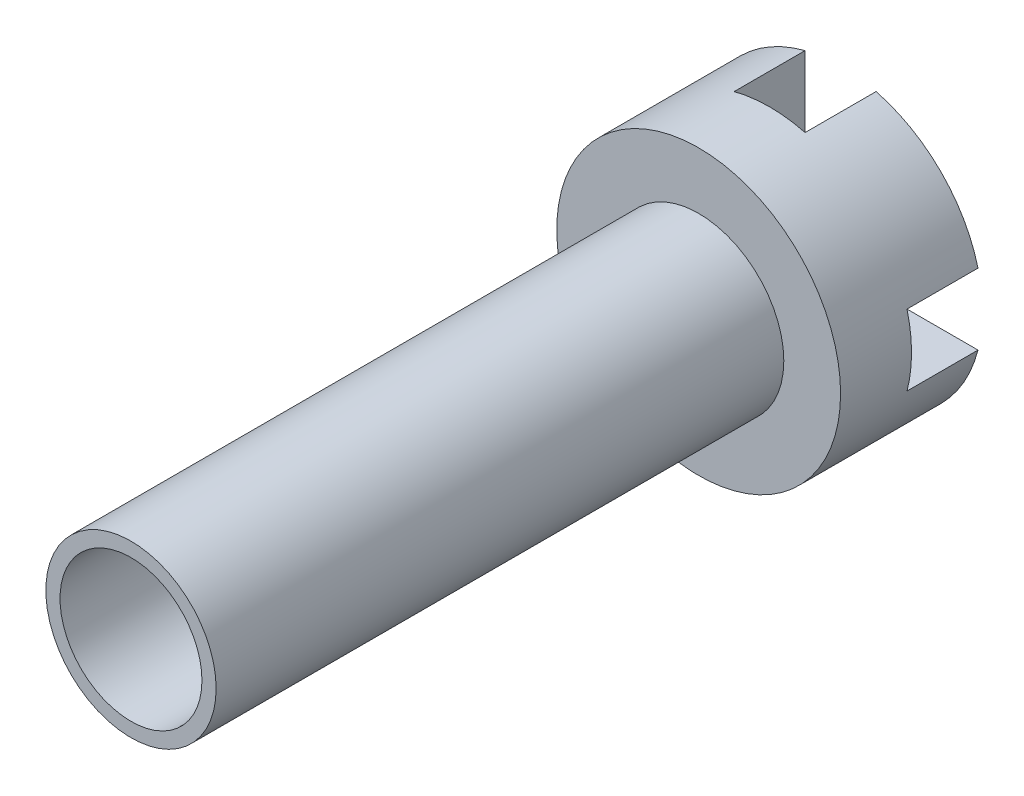
ISO-10303-21;
HEADER;
FILE_DESCRIPTION(('STEP AP214'),'2;1');
FILE_NAME('part.step','',(''),(''),'','','');
FILE_SCHEMA(('AUTOMOTIVE_DESIGN { 1 0 10303 214 1 1 1 1 }'));
ENDSEC;
DATA;
#1=APPLICATION_CONTEXT('core data for automotive mechanical design processes');
#2=APPLICATION_PROTOCOL_DEFINITION('international standard','automotive_design',2000,#1);
#3=PRODUCT_CONTEXT('',#1,'mechanical');
#4=PRODUCT('Part','Part','',(#3));
#5=PRODUCT_RELATED_PRODUCT_CATEGORY('part','',(#4));
#6=PRODUCT_DEFINITION_FORMATION('','',#4);
#7=PRODUCT_DEFINITION_CONTEXT('part definition',#1,'design');
#8=PRODUCT_DEFINITION('design','',#6,#7);
#9=PRODUCT_DEFINITION_SHAPE('','',#8);
#10=(LENGTH_UNIT() NAMED_UNIT(*) SI_UNIT(.MILLI.,.METRE.));
#11=(NAMED_UNIT(*) PLANE_ANGLE_UNIT() SI_UNIT($,.RADIAN.));
#12=(NAMED_UNIT(*) SI_UNIT($,.STERADIAN.) SOLID_ANGLE_UNIT());
#13=UNCERTAINTY_MEASURE_WITH_UNIT(LENGTH_MEASURE(1.E-05),#10,'distance_accuracy_value','');
#14=(GEOMETRIC_REPRESENTATION_CONTEXT(3) GLOBAL_UNCERTAINTY_ASSIGNED_CONTEXT((#13)) GLOBAL_UNIT_ASSIGNED_CONTEXT((#10,
#11,#12)) REPRESENTATION_CONTEXT('',''));
#15=CARTESIAN_POINT('',(0.,0.,0.));
#16=DIRECTION('',(0.,0.,1.));
#17=DIRECTION('',(1.,0.,0.));
#18=AXIS2_PLACEMENT_3D('',#15,#16,#17);
#19=CARTESIAN_POINT('',(0.,0.,10.));
#20=DIRECTION('',(0.,0.,-1.));
#21=DIRECTION('',(-1.,0.,0.));
#22=AXIS2_PLACEMENT_3D('',#19,#20,#21);
#23=CYLINDRICAL_SURFACE('',#22,10.);
#24=CARTESIAN_POINT('',(0.,0.,10.));
#25=DIRECTION('',(0.,0.,1.));
#26=DIRECTION('',(1.,0.,0.));
#27=AXIS2_PLACEMENT_3D('',#24,#25,#26);
#28=CIRCLE('',#27,10.);
#29=CARTESIAN_POINT('',(10.,0.,10.));
#30=VERTEX_POINT('',#29);
#31=EDGE_CURVE('E41',#30,#30,#28,.T.);
#32=ORIENTED_EDGE('',*,*,#31,.F.);
#33=EDGE_LOOP('',(#32));
#34=FACE_BOUND('',#33,.T.);
#35=DIRECTION('',(0.,0.,-1.));
#36=VECTOR('',#35,1.);
#37=CARTESIAN_POINT('',(-2.5,9.68245836551854,5.));
#38=LINE('',#37,#36);
#39=CARTESIAN_POINT('',(-2.5,9.68245836551854,5.));
#40=VERTEX_POINT('',#39);
#41=CARTESIAN_POINT('',(-2.5,9.68245836551854,0.));
#42=VERTEX_POINT('',#41);
#43=EDGE_CURVE('E106',#40,#42,#38,.T.);
#44=ORIENTED_EDGE('',*,*,#43,.T.);
#45=CARTESIAN_POINT('',(0.,0.,0.));
#46=DIRECTION('',(0.,0.,1.));
#47=DIRECTION('',(1.,0.,0.));
#48=AXIS2_PLACEMENT_3D('',#45,#46,#47);
#49=CIRCLE('',#48,10.);
#50=CARTESIAN_POINT('',(-9.68245836551854,2.5,0.));
#51=VERTEX_POINT('',#50);
#52=EDGE_CURVE('E210',#42,#51,#49,.T.);
#53=ORIENTED_EDGE('',*,*,#52,.T.);
#54=DIRECTION('',(0.,0.,-1.));
#55=VECTOR('',#54,1.);
#56=CARTESIAN_POINT('',(-9.68245836551854,2.5,5.));
#57=LINE('',#56,#55);
#58=CARTESIAN_POINT('',(-9.68245836551854,2.5,5.));
#59=VERTEX_POINT('',#58);
#60=EDGE_CURVE('E143',#59,#51,#57,.T.);
#61=ORIENTED_EDGE('',*,*,#60,.F.);
#62=CARTESIAN_POINT('',(0.,0.,5.));
#63=DIRECTION('',(0.,0.,-1.));
#64=DIRECTION('',(-1.,0.,0.));
#65=AXIS2_PLACEMENT_3D('',#62,#63,#64);
#66=CIRCLE('',#65,10.);
#67=CARTESIAN_POINT('',(-9.68245836551854,-2.5,5.));
#68=VERTEX_POINT('',#67);
#69=EDGE_CURVE('E148',#68,#59,#66,.T.);
#70=ORIENTED_EDGE('',*,*,#69,.F.);
#71=DIRECTION('',(0.,0.,-1.));
#72=VECTOR('',#71,1.);
#73=CARTESIAN_POINT('',(-9.68245836551854,-2.5,5.));
#74=LINE('',#73,#72);
#75=CARTESIAN_POINT('',(-9.68245836551854,-2.5,0.));
#76=VERTEX_POINT('',#75);
#77=EDGE_CURVE('E133',#68,#76,#74,.T.);
#78=ORIENTED_EDGE('',*,*,#77,.T.);
#79=CARTESIAN_POINT('',(-2.5,-9.68245836551854,0.));
#80=VERTEX_POINT('',#79);
#81=EDGE_CURVE('E212',#76,#80,#49,.T.);
#82=ORIENTED_EDGE('',*,*,#81,.T.);
#83=DIRECTION('',(0.,0.,-1.));
#84=VECTOR('',#83,1.);
#85=CARTESIAN_POINT('',(-2.5,-9.68245836551854,5.));
#86=LINE('',#85,#84);
#87=CARTESIAN_POINT('',(-2.5,-9.68245836551854,5.));
#88=VERTEX_POINT('',#87);
#89=EDGE_CURVE('E182',#88,#80,#86,.T.);
#90=ORIENTED_EDGE('',*,*,#89,.F.);
#91=CARTESIAN_POINT('',(0.,0.,5.));
#92=DIRECTION('',(0.,0.,-1.));
#93=DIRECTION('',(-1.,0.,0.));
#94=AXIS2_PLACEMENT_3D('',#91,#92,#93);
#95=CIRCLE('',#94,10.);
#96=CARTESIAN_POINT('',(2.5,-9.68245836551854,5.));
#97=VERTEX_POINT('',#96);
#98=EDGE_CURVE('E223',#97,#88,#95,.T.);
#99=ORIENTED_EDGE('',*,*,#98,.F.);
#100=DIRECTION('',(0.,0.,-1.));
#101=VECTOR('',#100,1.);
#102=CARTESIAN_POINT('',(2.5,-9.68245836551854,5.));
#103=LINE('',#102,#101);
#104=CARTESIAN_POINT('',(2.5,-9.68245836551854,0.));
#105=VERTEX_POINT('',#104);
#106=EDGE_CURVE('E184',#97,#105,#103,.T.);
#107=ORIENTED_EDGE('',*,*,#106,.T.);
#108=CARTESIAN_POINT('',(9.68245836551854,-2.5,0.));
#109=VERTEX_POINT('',#108);
#110=EDGE_CURVE('E205',#105,#109,#49,.T.);
#111=ORIENTED_EDGE('',*,*,#110,.T.);
#112=DIRECTION('',(0.,0.,-1.));
#113=VECTOR('',#112,1.);
#114=CARTESIAN_POINT('',(9.68245836551854,-2.5,5.));
#115=LINE('',#114,#113);
#116=CARTESIAN_POINT('',(9.68245836551854,-2.5,5.));
#117=VERTEX_POINT('',#116);
#118=EDGE_CURVE('E189',#117,#109,#115,.T.);
#119=ORIENTED_EDGE('',*,*,#118,.F.);
#120=CARTESIAN_POINT('',(0.,0.,5.));
#121=DIRECTION('',(0.,0.,-1.));
#122=DIRECTION('',(-1.,0.,0.));
#123=AXIS2_PLACEMENT_3D('',#120,#121,#122);
#124=CIRCLE('',#123,10.);
#125=CARTESIAN_POINT('',(9.68245836551854,2.5,5.));
#126=VERTEX_POINT('',#125);
#127=EDGE_CURVE('E233',#126,#117,#124,.T.);
#128=ORIENTED_EDGE('',*,*,#127,.F.);
#129=DIRECTION('',(0.,0.,-1.));
#130=VECTOR('',#129,1.);
#131=CARTESIAN_POINT('',(9.68245836551854,2.5,5.));
#132=LINE('',#131,#130);
#133=CARTESIAN_POINT('',(9.68245836551854,2.5,0.));
#134=VERTEX_POINT('',#133);
#135=EDGE_CURVE('E191',#126,#134,#132,.T.);
#136=ORIENTED_EDGE('',*,*,#135,.T.);
#137=CARTESIAN_POINT('',(2.5,9.68245836551854,0.));
#138=VERTEX_POINT('',#137);
#139=EDGE_CURVE('E36',#134,#138,#49,.T.);
#140=ORIENTED_EDGE('',*,*,#139,.T.);
#141=DIRECTION('',(0.,0.,-1.));
#142=VECTOR('',#141,1.);
#143=CARTESIAN_POINT('',(2.5,9.68245836551854,5.));
#144=LINE('',#143,#142);
#145=CARTESIAN_POINT('',(2.5,9.68245836551854,5.));
#146=VERTEX_POINT('',#145);
#147=EDGE_CURVE('E49',#146,#138,#144,.T.);
#148=ORIENTED_EDGE('',*,*,#147,.F.);
#149=CARTESIAN_POINT('',(0.,0.,5.));
#150=DIRECTION('',(0.,0.,-1.));
#151=DIRECTION('',(-1.,0.,0.));
#152=AXIS2_PLACEMENT_3D('',#149,#150,#151);
#153=CIRCLE('',#152,10.);
#154=EDGE_CURVE('E241',#40,#146,#153,.T.);
#155=ORIENTED_EDGE('',*,*,#154,.F.);
#156=EDGE_LOOP('',(#44,#53,#61,#70,#78,#82,#90,#99,#107,#111,#119,#128,#136,#140,#148,#155));
#157=FACE_BOUND('',#156,.T.);
#158=ADVANCED_FACE('F33',(#34,#157),#23,.T.);
#159=CARTESIAN_POINT('',(0.,0.,0.));
#160=DIRECTION('',(0.,0.,1.));
#161=DIRECTION('',(1.,0.,0.));
#162=AXIS2_PLACEMENT_3D('',#159,#160,#161);
#163=PLANE('',#162);
#164=DIRECTION('',(0.,-1.,0.));
#165=VECTOR('',#164,1.);
#166=CARTESIAN_POINT('',(-2.5,0.,0.));
#167=LINE('',#166,#165);
#168=CARTESIAN_POINT('',(-2.5,2.5,0.));
#169=VERTEX_POINT('',#168);
#170=EDGE_CURVE('E158',#42,#169,#167,.T.);
#171=ORIENTED_EDGE('',*,*,#170,.T.);
#172=DIRECTION('',(-1.,0.,0.));
#173=VECTOR('',#172,1.);
#174=CARTESIAN_POINT('',(0.,2.5,0.));
#175=LINE('',#174,#173);
#176=EDGE_CURVE('E99',#169,#51,#175,.T.);
#177=ORIENTED_EDGE('',*,*,#176,.T.);
#178=ORIENTED_EDGE('',*,*,#52,.F.);
#179=EDGE_LOOP('',(#171,#177,#178));
#180=FACE_BOUND('',#179,.T.);
#181=ADVANCED_FACE('F249',(#180),#163,.F.);
#182=ORIENTED_EDGE('',*,*,#81,.F.);
#183=DIRECTION('',(-1.,0.,0.));
#184=VECTOR('',#183,1.);
#185=CARTESIAN_POINT('',(0.,-2.5,0.));
#186=LINE('',#185,#184);
#187=CARTESIAN_POINT('',(-2.5,-2.5,0.));
#188=VERTEX_POINT('',#187);
#189=EDGE_CURVE('E138',#188,#76,#186,.T.);
#190=ORIENTED_EDGE('',*,*,#189,.F.);
#191=DIRECTION('',(0.,-1.,0.));
#192=VECTOR('',#191,1.);
#193=CARTESIAN_POINT('',(-2.5,0.,0.));
#194=LINE('',#193,#192);
#195=EDGE_CURVE('E171',#188,#80,#194,.T.);
#196=ORIENTED_EDGE('',*,*,#195,.T.);
#197=EDGE_LOOP('',(#182,#190,#196));
#198=FACE_BOUND('',#197,.T.);
#199=ADVANCED_FACE('F219',(#198),#163,.F.);
#200=DIRECTION('',(-1.,0.,0.));
#201=VECTOR('',#200,1.);
#202=CARTESIAN_POINT('',(0.,2.5,0.));
#203=LINE('',#202,#201);
#204=CARTESIAN_POINT('',(2.5,2.5,0.));
#205=VERTEX_POINT('',#204);
#206=EDGE_CURVE('E163',#134,#205,#203,.T.);
#207=ORIENTED_EDGE('',*,*,#206,.T.);
#208=DIRECTION('',(0.,-1.,0.));
#209=VECTOR('',#208,1.);
#210=CARTESIAN_POINT('',(2.5,0.,0.));
#211=LINE('',#210,#209);
#212=EDGE_CURVE('E161',#138,#205,#211,.T.);
#213=ORIENTED_EDGE('',*,*,#212,.F.);
#214=ORIENTED_EDGE('',*,*,#139,.F.);
#215=EDGE_LOOP('',(#207,#213,#214));
#216=FACE_BOUND('',#215,.T.);
#217=ADVANCED_FACE('F257',(#216),#163,.F.);
#218=CARTESIAN_POINT('',(0.,0.,10.));
#219=DIRECTION('',(0.,0.,1.));
#220=DIRECTION('',(1.,0.,0.));
#221=AXIS2_PLACEMENT_3D('',#218,#219,#220);
#222=PLANE('',#221);
#223=CARTESIAN_POINT('',(0.,0.,10.));
#224=DIRECTION('',(0.,0.,1.));
#225=DIRECTION('',(1.,0.,0.));
#226=AXIS2_PLACEMENT_3D('',#223,#224,#225);
#227=CIRCLE('',#226,6.);
#228=CARTESIAN_POINT('',(6.,0.,10.));
#229=VERTEX_POINT('',#228);
#230=EDGE_CURVE('E11',#229,#229,#227,.T.);
#231=ORIENTED_EDGE('',*,*,#230,.F.);
#232=EDGE_LOOP('',(#231));
#233=FACE_BOUND('',#232,.T.);
#234=ORIENTED_EDGE('',*,*,#31,.T.);
#235=EDGE_LOOP('',(#234));
#236=FACE_BOUND('',#235,.T.);
#237=ADVANCED_FACE('F259',(#233,#236),#222,.T.);
#238=ORIENTED_EDGE('',*,*,#110,.F.);
#239=DIRECTION('',(0.,-1.,0.));
#240=VECTOR('',#239,1.);
#241=CARTESIAN_POINT('',(2.5,0.,0.));
#242=LINE('',#241,#240);
#243=CARTESIAN_POINT('',(2.5,-2.5,0.));
#244=VERTEX_POINT('',#243);
#245=EDGE_CURVE('E169',#244,#105,#242,.T.);
#246=ORIENTED_EDGE('',*,*,#245,.F.);
#247=DIRECTION('',(-1.,0.,0.));
#248=VECTOR('',#247,1.);
#249=CARTESIAN_POINT('',(0.,-2.5,0.));
#250=LINE('',#249,#248);
#251=EDGE_CURVE('E166',#109,#244,#250,.T.);
#252=ORIENTED_EDGE('',*,*,#251,.F.);
#253=EDGE_LOOP('',(#238,#246,#252));
#254=FACE_BOUND('',#253,.T.);
#255=ADVANCED_FACE('F260',(#254),#163,.F.);
#256=CARTESIAN_POINT('',(0.,0.,50.));
#257=DIRECTION('',(0.,0.,-1.));
#258=DIRECTION('',(-1.,0.,0.));
#259=AXIS2_PLACEMENT_3D('',#256,#257,#258);
#260=CYLINDRICAL_SURFACE('',#259,6.);
#261=CARTESIAN_POINT('',(0.,0.,50.));
#262=DIRECTION('',(0.,0.,1.));
#263=DIRECTION('',(1.,0.,0.));
#264=AXIS2_PLACEMENT_3D('',#261,#262,#263);
#265=CIRCLE('',#264,6.);
#266=CARTESIAN_POINT('',(6.,0.,50.));
#267=VERTEX_POINT('',#266);
#268=EDGE_CURVE('E201',#267,#267,#265,.T.);
#269=ORIENTED_EDGE('',*,*,#268,.F.);
#270=EDGE_LOOP('',(#269));
#271=FACE_BOUND('',#270,.T.);
#272=ORIENTED_EDGE('',*,*,#230,.T.);
#273=EDGE_LOOP('',(#272));
#274=FACE_BOUND('',#273,.T.);
#275=ADVANCED_FACE('F268',(#271,#274),#260,.T.);
#276=CARTESIAN_POINT('',(0.,0.,50.));
#277=DIRECTION('',(0.,0.,1.));
#278=DIRECTION('',(1.,0.,0.));
#279=AXIS2_PLACEMENT_3D('',#276,#277,#278);
#280=PLANE('',#279);
#281=CARTESIAN_POINT('',(0.,0.,50.));
#282=DIRECTION('',(0.,0.,1.));
#283=DIRECTION('',(1.,0.,0.));
#284=AXIS2_PLACEMENT_3D('',#281,#282,#283);
#285=CIRCLE('',#284,5.);
#286=CARTESIAN_POINT('',(5.,0.,50.));
#287=VERTEX_POINT('',#286);
#288=EDGE_CURVE('E179',#287,#287,#285,.T.);
#289=ORIENTED_EDGE('',*,*,#288,.F.);
#290=EDGE_LOOP('',(#289));
#291=FACE_BOUND('',#290,.T.);
#292=ORIENTED_EDGE('',*,*,#268,.T.);
#293=EDGE_LOOP('',(#292));
#294=FACE_BOUND('',#293,.T.);
#295=ADVANCED_FACE('F393',(#291,#294),#280,.T.);
#296=CARTESIAN_POINT('',(0.,0.,20.));
#297=DIRECTION('',(0.,0.,1.));
#298=DIRECTION('',(1.,0.,0.));
#299=AXIS2_PLACEMENT_3D('',#296,#297,#298);
#300=CYLINDRICAL_SURFACE('',#299,5.);
#301=CARTESIAN_POINT('',(0.,0.,20.));
#302=DIRECTION('',(0.,0.,1.));
#303=DIRECTION('',(1.,0.,0.));
#304=AXIS2_PLACEMENT_3D('',#301,#302,#303);
#305=CIRCLE('',#304,5.);
#306=CARTESIAN_POINT('',(5.,0.,20.));
#307=VERTEX_POINT('',#306);
#308=EDGE_CURVE('E198',#307,#307,#305,.T.);
#309=ORIENTED_EDGE('',*,*,#308,.F.);
#310=EDGE_LOOP('',(#309));
#311=FACE_BOUND('',#310,.T.);
#312=ORIENTED_EDGE('',*,*,#288,.T.);
#313=EDGE_LOOP('',(#312));
#314=FACE_BOUND('',#313,.T.);
#315=ADVANCED_FACE('F389',(#311,#314),#300,.F.);
#316=CARTESIAN_POINT('',(0.,0.,20.));
#317=DIRECTION('',(0.,0.,1.));
#318=DIRECTION('',(1.,0.,0.));
#319=AXIS2_PLACEMENT_3D('',#316,#317,#318);
#320=PLANE('',#319);
#321=ORIENTED_EDGE('',*,*,#308,.T.);
#322=EDGE_LOOP('',(#321));
#323=FACE_BOUND('',#322,.T.);
#324=ADVANCED_FACE('F304',(#323),#320,.T.);
#325=CARTESIAN_POINT('',(-2.5,0.,5.));
#326=DIRECTION('',(1.,0.,0.));
#327=DIRECTION('',(0.,1.,0.));
#328=AXIS2_PLACEMENT_3D('',#325,#326,#327);
#329=PLANE('',#328);
#330=ORIENTED_EDGE('',*,*,#170,.F.);
#331=ORIENTED_EDGE('',*,*,#43,.F.);
#332=DIRECTION('',(0.,-1.,0.));
#333=VECTOR('',#332,1.);
#334=CARTESIAN_POINT('',(-2.5,0.,5.));
#335=LINE('',#334,#333);
#336=CARTESIAN_POINT('',(-2.5,2.5,5.));
#337=VERTEX_POINT('',#336);
#338=EDGE_CURVE('E176',#40,#337,#335,.T.);
#339=ORIENTED_EDGE('',*,*,#338,.T.);
#340=DIRECTION('',(0.,0.,-1.));
#341=VECTOR('',#340,1.);
#342=CARTESIAN_POINT('',(-2.5,2.5,5.));
#343=LINE('',#342,#341);
#344=EDGE_CURVE('E177',#337,#169,#343,.T.);
#345=ORIENTED_EDGE('',*,*,#344,.T.);
#346=EDGE_LOOP('',(#330,#331,#339,#345));
#347=FACE_BOUND('',#346,.T.);
#348=ADVANCED_FACE('F244',(#347),#329,.T.);
#349=CARTESIAN_POINT('',(0.,2.5,5.));
#350=DIRECTION('',(0.,-1.,0.));
#351=DIRECTION('',(0.,0.,-1.));
#352=AXIS2_PLACEMENT_3D('',#349,#350,#351);
#353=PLANE('',#352);
#354=ORIENTED_EDGE('',*,*,#176,.F.);
#355=ORIENTED_EDGE('',*,*,#344,.F.);
#356=DIRECTION('',(-1.,0.,0.));
#357=VECTOR('',#356,1.);
#358=CARTESIAN_POINT('',(0.,2.5,5.));
#359=LINE('',#358,#357);
#360=EDGE_CURVE('E58',#337,#59,#359,.T.);
#361=ORIENTED_EDGE('',*,*,#360,.T.);
#362=ORIENTED_EDGE('',*,*,#60,.T.);
#363=EDGE_LOOP('',(#354,#355,#361,#362));
#364=FACE_BOUND('',#363,.T.);
#365=ADVANCED_FACE('F246',(#364),#353,.T.);
#366=CARTESIAN_POINT('',(0.,-2.5,5.));
#367=DIRECTION('',(0.,-1.,0.));
#368=DIRECTION('',(1.,0.,0.));
#369=AXIS2_PLACEMENT_3D('',#366,#367,#368);
#370=PLANE('',#369);
#371=ORIENTED_EDGE('',*,*,#189,.T.);
#372=ORIENTED_EDGE('',*,*,#77,.F.);
#373=DIRECTION('',(-1.,0.,0.));
#374=VECTOR('',#373,1.);
#375=CARTESIAN_POINT('',(0.,-2.5,5.));
#376=LINE('',#375,#374);
#377=CARTESIAN_POINT('',(-2.5,-2.5,5.));
#378=VERTEX_POINT('',#377);
#379=EDGE_CURVE('E136',#378,#68,#376,.T.);
#380=ORIENTED_EDGE('',*,*,#379,.F.);
#381=DIRECTION('',(0.,0.,-1.));
#382=VECTOR('',#381,1.);
#383=CARTESIAN_POINT('',(-2.5,-2.5,5.));
#384=LINE('',#383,#382);
#385=EDGE_CURVE('E144',#378,#188,#384,.T.);
#386=ORIENTED_EDGE('',*,*,#385,.T.);
#387=EDGE_LOOP('',(#371,#372,#380,#386));
#388=FACE_BOUND('',#387,.T.);
#389=ADVANCED_FACE('F135',(#388),#370,.F.);
#390=CARTESIAN_POINT('',(-2.5,0.,5.));
#391=DIRECTION('',(1.,0.,0.));
#392=DIRECTION('',(0.,1.,0.));
#393=AXIS2_PLACEMENT_3D('',#390,#391,#392);
#394=PLANE('',#393);
#395=ORIENTED_EDGE('',*,*,#195,.F.);
#396=ORIENTED_EDGE('',*,*,#385,.F.);
#397=DIRECTION('',(0.,-1.,0.));
#398=VECTOR('',#397,1.);
#399=CARTESIAN_POINT('',(-2.5,0.,5.));
#400=LINE('',#399,#398);
#401=EDGE_CURVE('E151',#378,#88,#400,.T.);
#402=ORIENTED_EDGE('',*,*,#401,.T.);
#403=ORIENTED_EDGE('',*,*,#89,.T.);
#404=EDGE_LOOP('',(#395,#396,#402,#403));
#405=FACE_BOUND('',#404,.T.);
#406=ADVANCED_FACE('F222',(#405),#394,.T.);
#407=CARTESIAN_POINT('',(2.5,0.,5.));
#408=DIRECTION('',(1.,0.,0.));
#409=DIRECTION('',(0.,1.,0.));
#410=AXIS2_PLACEMENT_3D('',#407,#408,#409);
#411=PLANE('',#410);
#412=ORIENTED_EDGE('',*,*,#245,.T.);
#413=ORIENTED_EDGE('',*,*,#106,.F.);
#414=DIRECTION('',(0.,-1.,0.));
#415=VECTOR('',#414,1.);
#416=CARTESIAN_POINT('',(2.5,0.,5.));
#417=LINE('',#416,#415);
#418=CARTESIAN_POINT('',(2.5,-2.5,5.));
#419=VERTEX_POINT('',#418);
#420=EDGE_CURVE('E227',#419,#97,#417,.T.);
#421=ORIENTED_EDGE('',*,*,#420,.F.);
#422=DIRECTION('',(0.,0.,-1.));
#423=VECTOR('',#422,1.);
#424=CARTESIAN_POINT('',(2.5,-2.5,5.));
#425=LINE('',#424,#423);
#426=EDGE_CURVE('E187',#419,#244,#425,.T.);
#427=ORIENTED_EDGE('',*,*,#426,.T.);
#428=EDGE_LOOP('',(#412,#413,#421,#427));
#429=FACE_BOUND('',#428,.T.);
#430=ADVANCED_FACE('F331',(#429),#411,.F.);
#431=CARTESIAN_POINT('',(0.,-2.5,5.));
#432=DIRECTION('',(0.,-1.,0.));
#433=DIRECTION('',(1.,0.,0.));
#434=AXIS2_PLACEMENT_3D('',#431,#432,#433);
#435=PLANE('',#434);
#436=ORIENTED_EDGE('',*,*,#251,.T.);
#437=ORIENTED_EDGE('',*,*,#426,.F.);
#438=DIRECTION('',(-1.,0.,0.));
#439=VECTOR('',#438,1.);
#440=CARTESIAN_POINT('',(0.,-2.5,5.));
#441=LINE('',#440,#439);
#442=EDGE_CURVE('E229',#117,#419,#441,.T.);
#443=ORIENTED_EDGE('',*,*,#442,.F.);
#444=ORIENTED_EDGE('',*,*,#118,.T.);
#445=EDGE_LOOP('',(#436,#437,#443,#444));
#446=FACE_BOUND('',#445,.T.);
#447=ADVANCED_FACE('F340',(#446),#435,.F.);
#448=CARTESIAN_POINT('',(0.,2.5,5.));
#449=DIRECTION('',(0.,-1.,0.));
#450=DIRECTION('',(0.,0.,-1.));
#451=AXIS2_PLACEMENT_3D('',#448,#449,#450);
#452=PLANE('',#451);
#453=ORIENTED_EDGE('',*,*,#206,.F.);
#454=ORIENTED_EDGE('',*,*,#135,.F.);
#455=DIRECTION('',(-1.,0.,0.));
#456=VECTOR('',#455,1.);
#457=CARTESIAN_POINT('',(0.,2.5,5.));
#458=LINE('',#457,#456);
#459=CARTESIAN_POINT('',(2.5,2.5,5.));
#460=VERTEX_POINT('',#459);
#461=EDGE_CURVE('E236',#126,#460,#458,.T.);
#462=ORIENTED_EDGE('',*,*,#461,.T.);
#463=DIRECTION('',(0.,0.,-1.));
#464=VECTOR('',#463,1.);
#465=CARTESIAN_POINT('',(2.5,2.5,5.));
#466=LINE('',#465,#464);
#467=EDGE_CURVE('E194',#460,#205,#466,.T.);
#468=ORIENTED_EDGE('',*,*,#467,.T.);
#469=EDGE_LOOP('',(#453,#454,#462,#468));
#470=FACE_BOUND('',#469,.T.);
#471=ADVANCED_FACE('F255',(#470),#452,.T.);
#472=CARTESIAN_POINT('',(2.5,0.,5.));
#473=DIRECTION('',(1.,0.,0.));
#474=DIRECTION('',(0.,1.,0.));
#475=AXIS2_PLACEMENT_3D('',#472,#473,#474);
#476=PLANE('',#475);
#477=ORIENTED_EDGE('',*,*,#212,.T.);
#478=ORIENTED_EDGE('',*,*,#467,.F.);
#479=DIRECTION('',(0.,-1.,0.));
#480=VECTOR('',#479,1.);
#481=CARTESIAN_POINT('',(2.5,0.,5.));
#482=LINE('',#481,#480);
#483=EDGE_CURVE('E238',#146,#460,#482,.T.);
#484=ORIENTED_EDGE('',*,*,#483,.F.);
#485=ORIENTED_EDGE('',*,*,#147,.T.);
#486=EDGE_LOOP('',(#477,#478,#484,#485));
#487=FACE_BOUND('',#486,.T.);
#488=ADVANCED_FACE('F253',(#487),#476,.F.);
#489=CARTESIAN_POINT('',(0.,0.,5.));
#490=DIRECTION('',(0.,0.,-1.));
#491=DIRECTION('',(-1.,0.,0.));
#492=AXIS2_PLACEMENT_3D('',#489,#490,#491);
#493=PLANE('',#492);
#494=ORIENTED_EDGE('',*,*,#338,.F.);
#495=ORIENTED_EDGE('',*,*,#154,.T.);
#496=ORIENTED_EDGE('',*,*,#483,.T.);
#497=ORIENTED_EDGE('',*,*,#461,.F.);
#498=ORIENTED_EDGE('',*,*,#127,.T.);
#499=ORIENTED_EDGE('',*,*,#442,.T.);
#500=ORIENTED_EDGE('',*,*,#420,.T.);
#501=ORIENTED_EDGE('',*,*,#98,.T.);
#502=ORIENTED_EDGE('',*,*,#401,.F.);
#503=ORIENTED_EDGE('',*,*,#379,.T.);
#504=ORIENTED_EDGE('',*,*,#69,.T.);
#505=ORIENTED_EDGE('',*,*,#360,.F.);
#506=EDGE_LOOP('',(#494,#495,#496,#497,#498,#499,#500,#501,#502,#503,#504,#505));
#507=FACE_BOUND('',#506,.T.);
#508=ADVANCED_FACE('F147',(#507),#493,.T.);
#509=CLOSED_SHELL('',(#158,#181,#199,#217,#237,#255,#275,#295,#315,#324,#348,#365,#389,#406,
#430,#447,#471,#488,#508));
#510=MANIFOLD_SOLID_BREP('B2',#509);
#511=ADVANCED_BREP_SHAPE_REPRESENTATION('',(#18,#510),#14);
#512=SHAPE_DEFINITION_REPRESENTATION(#9,#511);
ENDSEC;
END-ISO-10303-21;
